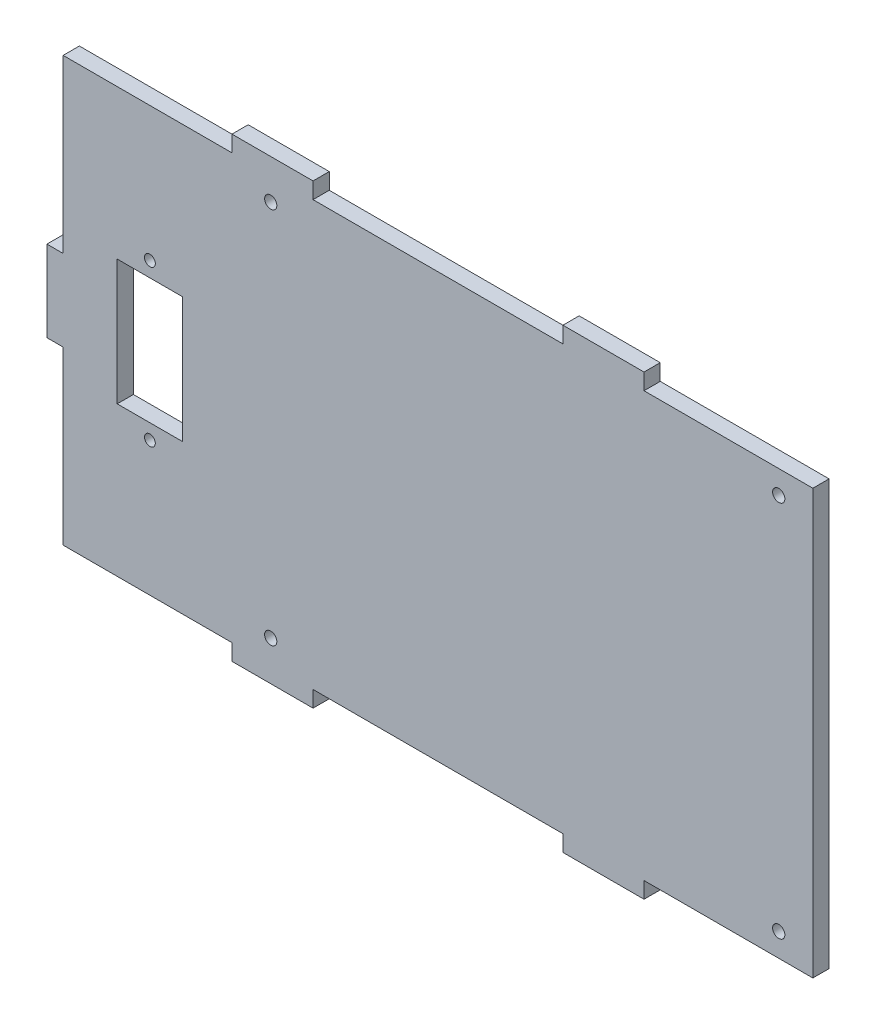
ISO-10303-21;
HEADER;
FILE_DESCRIPTION(('STEP AP214'),'2;1');
FILE_NAME('part.step','',(''),(''),'','','');
FILE_SCHEMA(('AUTOMOTIVE_DESIGN { 1 0 10303 214 1 1 1 1 }'));
ENDSEC;
DATA;
#1=APPLICATION_CONTEXT('core data for automotive mechanical design processes');
#2=APPLICATION_PROTOCOL_DEFINITION('international standard','automotive_design',2000,#1);
#3=PRODUCT_CONTEXT('',#1,'mechanical');
#4=PRODUCT('Part','Part','',(#3));
#5=PRODUCT_RELATED_PRODUCT_CATEGORY('part','',(#4));
#6=PRODUCT_DEFINITION_FORMATION('','',#4);
#7=PRODUCT_DEFINITION_CONTEXT('part definition',#1,'design');
#8=PRODUCT_DEFINITION('design','',#6,#7);
#9=PRODUCT_DEFINITION_SHAPE('','',#8);
#10=(LENGTH_UNIT() NAMED_UNIT(*) SI_UNIT(.MILLI.,.METRE.));
#11=(NAMED_UNIT(*) PLANE_ANGLE_UNIT() SI_UNIT($,.RADIAN.));
#12=(NAMED_UNIT(*) SI_UNIT($,.STERADIAN.) SOLID_ANGLE_UNIT());
#13=UNCERTAINTY_MEASURE_WITH_UNIT(LENGTH_MEASURE(1.E-05),#10,'distance_accuracy_value','');
#14=(GEOMETRIC_REPRESENTATION_CONTEXT(3) GLOBAL_UNCERTAINTY_ASSIGNED_CONTEXT((#13)) GLOBAL_UNIT_ASSIGNED_CONTEXT((#10,
#11,#12)) REPRESENTATION_CONTEXT('',''));
#15=CARTESIAN_POINT('',(0.,0.,0.));
#16=DIRECTION('',(0.,0.,1.));
#17=DIRECTION('',(1.,0.,0.));
#18=AXIS2_PLACEMENT_3D('',#15,#16,#17);
#19=CARTESIAN_POINT('',(-36.5479186476367,39.7550378756003,3.));
#20=DIRECTION('',(1.,0.,0.));
#21=DIRECTION('',(0.,1.,0.));
#22=AXIS2_PLACEMENT_3D('',#19,#20,#21);
#23=PLANE('',#22);
#24=DIRECTION('',(0.,-1.,0.));
#25=VECTOR('',#24,1.);
#26=CARTESIAN_POINT('',(-36.5479186476367,39.7550378756003,0.));
#27=LINE('',#26,#25);
#28=CARTESIAN_POINT('',(-36.5479186476367,71.4900378756003,0.));
#29=VERTEX_POINT('',#28);
#30=CARTESIAN_POINT('',(-36.5479186476367,39.7550378756003,0.));
#31=VERTEX_POINT('',#30);
#32=EDGE_CURVE('E279',#29,#31,#27,.T.);
#33=ORIENTED_EDGE('',*,*,#32,.T.);
#34=DIRECTION('',(0.,0.,-1.));
#35=VECTOR('',#34,1.);
#36=CARTESIAN_POINT('',(-36.5479186476367,39.7550378756003,3.));
#37=LINE('',#36,#35);
#38=CARTESIAN_POINT('',(-36.5479186476367,39.7550378756003,3.));
#39=VERTEX_POINT('',#38);
#40=EDGE_CURVE('E11',#39,#31,#37,.T.);
#41=ORIENTED_EDGE('',*,*,#40,.F.);
#42=DIRECTION('',(0.,-1.,0.));
#43=VECTOR('',#42,1.);
#44=CARTESIAN_POINT('',(-36.5479186476367,39.7550378756003,3.));
#45=LINE('',#44,#43);
#46=CARTESIAN_POINT('',(-36.5479186476367,71.4900378756003,3.));
#47=VERTEX_POINT('',#46);
#48=EDGE_CURVE('E282',#47,#39,#45,.T.);
#49=ORIENTED_EDGE('',*,*,#48,.F.);
#50=DIRECTION('',(0.,0.,-1.));
#51=VECTOR('',#50,1.);
#52=CARTESIAN_POINT('',(-36.5479186476367,71.4900378756003,3.));
#53=LINE('',#52,#51);
#54=EDGE_CURVE('E332',#47,#29,#53,.T.);
#55=ORIENTED_EDGE('',*,*,#54,.T.);
#56=EDGE_LOOP('',(#33,#41,#49,#55));
#57=FACE_BOUND('',#56,.T.);
#58=ADVANCED_FACE('F33',(#57),#23,.F.);
#59=CARTESIAN_POINT('',(-39.5479186476367,39.7550378756003,3.));
#60=DIRECTION('',(0.,-1.,0.));
#61=DIRECTION('',(0.,0.,-1.));
#62=AXIS2_PLACEMENT_3D('',#59,#60,#61);
#63=PLANE('',#62);
#64=DIRECTION('',(-1.,0.,0.));
#65=VECTOR('',#64,1.);
#66=CARTESIAN_POINT('',(-39.5479186476367,39.7550378756003,0.));
#67=LINE('',#66,#65);
#68=CARTESIAN_POINT('',(-39.5479186476367,39.7550378756003,0.));
#69=VERTEX_POINT('',#68);
#70=EDGE_CURVE('E335',#31,#69,#67,.T.);
#71=ORIENTED_EDGE('',*,*,#70,.T.);
#72=DIRECTION('',(0.,0.,-1.));
#73=VECTOR('',#72,1.);
#74=CARTESIAN_POINT('',(-39.5479186476367,39.7550378756003,3.));
#75=LINE('',#74,#73);
#76=CARTESIAN_POINT('',(-39.5479186476367,39.7550378756003,3.));
#77=VERTEX_POINT('',#76);
#78=EDGE_CURVE('E40',#77,#69,#75,.T.);
#79=ORIENTED_EDGE('',*,*,#78,.F.);
#80=DIRECTION('',(-1.,0.,0.));
#81=VECTOR('',#80,1.);
#82=CARTESIAN_POINT('',(-39.5479186476367,39.7550378756003,3.));
#83=LINE('',#82,#81);
#84=EDGE_CURVE('E285',#39,#77,#83,.T.);
#85=ORIENTED_EDGE('',*,*,#84,.F.);
#86=ORIENTED_EDGE('',*,*,#40,.T.);
#87=EDGE_LOOP('',(#71,#79,#85,#86));
#88=FACE_BOUND('',#87,.T.);
#89=ADVANCED_FACE('F471',(#88),#63,.F.);
#90=CARTESIAN_POINT('',(-39.5479186476367,24.7550378756003,3.));
#91=DIRECTION('',(1.,0.,0.));
#92=DIRECTION('',(0.,0.,-1.));
#93=AXIS2_PLACEMENT_3D('',#90,#91,#92);
#94=PLANE('',#93);
#95=DIRECTION('',(0.,-1.,0.));
#96=VECTOR('',#95,1.);
#97=CARTESIAN_POINT('',(-39.5479186476367,24.7550378756003,0.));
#98=LINE('',#97,#96);
#99=CARTESIAN_POINT('',(-39.5479186476367,24.7550378756003,0.));
#100=VERTEX_POINT('',#99);
#101=EDGE_CURVE('E337',#69,#100,#98,.T.);
#102=ORIENTED_EDGE('',*,*,#101,.T.);
#103=DIRECTION('',(0.,0.,-1.));
#104=VECTOR('',#103,1.);
#105=CARTESIAN_POINT('',(-39.5479186476367,24.7550378756003,3.));
#106=LINE('',#105,#104);
#107=CARTESIAN_POINT('',(-39.5479186476367,24.7550378756003,3.));
#108=VERTEX_POINT('',#107);
#109=EDGE_CURVE('E442',#108,#100,#106,.T.);
#110=ORIENTED_EDGE('',*,*,#109,.F.);
#111=DIRECTION('',(0.,-1.,0.));
#112=VECTOR('',#111,1.);
#113=CARTESIAN_POINT('',(-39.5479186476367,24.7550378756003,3.));
#114=LINE('',#113,#112);
#115=EDGE_CURVE('E288',#77,#108,#114,.T.);
#116=ORIENTED_EDGE('',*,*,#115,.F.);
#117=ORIENTED_EDGE('',*,*,#78,.T.);
#118=EDGE_LOOP('',(#102,#110,#116,#117));
#119=FACE_BOUND('',#118,.T.);
#120=ADVANCED_FACE('F449',(#119),#94,.F.);
#121=CARTESIAN_POINT('',(-36.5479186476367,24.7550378756003,3.));
#122=DIRECTION('',(0.,1.,0.));
#123=DIRECTION('',(-1.,0.,0.));
#124=AXIS2_PLACEMENT_3D('',#121,#122,#123);
#125=PLANE('',#124);
#126=DIRECTION('',(1.,0.,0.));
#127=VECTOR('',#126,1.);
#128=CARTESIAN_POINT('',(-36.5479186476367,24.7550378756003,0.));
#129=LINE('',#128,#127);
#130=CARTESIAN_POINT('',(-36.5479186476367,24.7550378756003,0.));
#131=VERTEX_POINT('',#130);
#132=EDGE_CURVE('E339',#100,#131,#129,.T.);
#133=ORIENTED_EDGE('',*,*,#132,.T.);
#134=DIRECTION('',(0.,0.,-1.));
#135=VECTOR('',#134,1.);
#136=CARTESIAN_POINT('',(-36.5479186476367,24.7550378756003,3.));
#137=LINE('',#136,#135);
#138=CARTESIAN_POINT('',(-36.5479186476367,24.7550378756003,3.));
#139=VERTEX_POINT('',#138);
#140=EDGE_CURVE('E439',#139,#131,#137,.T.);
#141=ORIENTED_EDGE('',*,*,#140,.F.);
#142=DIRECTION('',(1.,0.,0.));
#143=VECTOR('',#142,1.);
#144=CARTESIAN_POINT('',(-36.5479186476367,24.7550378756003,3.));
#145=LINE('',#144,#143);
#146=EDGE_CURVE('E290',#108,#139,#145,.T.);
#147=ORIENTED_EDGE('',*,*,#146,.F.);
#148=ORIENTED_EDGE('',*,*,#109,.T.);
#149=EDGE_LOOP('',(#133,#141,#147,#148));
#150=FACE_BOUND('',#149,.T.);
#151=ADVANCED_FACE('F459',(#150),#125,.F.);
#152=CARTESIAN_POINT('',(-36.5479186476367,-6.97996212439974,3.));
#153=DIRECTION('',(1.,0.,0.));
#154=DIRECTION('',(0.,1.,0.));
#155=AXIS2_PLACEMENT_3D('',#152,#153,#154);
#156=PLANE('',#155);
#157=DIRECTION('',(0.,-1.,0.));
#158=VECTOR('',#157,1.);
#159=CARTESIAN_POINT('',(-36.5479186476367,-6.97996212439974,0.));
#160=LINE('',#159,#158);
#161=CARTESIAN_POINT('',(-36.5479186476367,-6.97996212439974,0.));
#162=VERTEX_POINT('',#161);
#163=EDGE_CURVE('E341',#131,#162,#160,.T.);
#164=ORIENTED_EDGE('',*,*,#163,.T.);
#165=DIRECTION('',(0.,0.,-1.));
#166=VECTOR('',#165,1.);
#167=CARTESIAN_POINT('',(-36.5479186476367,-6.97996212439974,3.));
#168=LINE('',#167,#166);
#169=CARTESIAN_POINT('',(-36.5479186476367,-6.97996212439974,3.));
#170=VERTEX_POINT('',#169);
#171=EDGE_CURVE('E436',#170,#162,#168,.T.);
#172=ORIENTED_EDGE('',*,*,#171,.F.);
#173=DIRECTION('',(0.,-1.,0.));
#174=VECTOR('',#173,1.);
#175=CARTESIAN_POINT('',(-36.5479186476367,-6.97996212439974,3.));
#176=LINE('',#175,#174);
#177=EDGE_CURVE('E292',#139,#170,#176,.T.);
#178=ORIENTED_EDGE('',*,*,#177,.F.);
#179=ORIENTED_EDGE('',*,*,#140,.T.);
#180=EDGE_LOOP('',(#164,#172,#178,#179));
#181=FACE_BOUND('',#180,.T.);
#182=ADVANCED_FACE('F463',(#181),#156,.F.);
#183=CARTESIAN_POINT('',(-36.5479186476367,-6.97996212439974,3.));
#184=DIRECTION('',(0.,1.,0.));
#185=DIRECTION('',(-1.,0.,0.));
#186=AXIS2_PLACEMENT_3D('',#183,#184,#185);
#187=PLANE('',#186);
#188=DIRECTION('',(1.,0.,0.));
#189=VECTOR('',#188,1.);
#190=CARTESIAN_POINT('',(-36.5479186476367,-6.97996212439974,0.));
#191=LINE('',#190,#189);
#192=CARTESIAN_POINT('',(-5.31791864763672,-6.97996212439974,0.));
#193=VERTEX_POINT('',#192);
#194=EDGE_CURVE('E343',#162,#193,#191,.T.);
#195=ORIENTED_EDGE('',*,*,#194,.T.);
#196=DIRECTION('',(0.,0.,-1.));
#197=VECTOR('',#196,1.);
#198=CARTESIAN_POINT('',(-5.31791864763672,-6.97996212439974,3.));
#199=LINE('',#198,#197);
#200=CARTESIAN_POINT('',(-5.31791864763672,-6.97996212439974,3.));
#201=VERTEX_POINT('',#200);
#202=EDGE_CURVE('E433',#201,#193,#199,.T.);
#203=ORIENTED_EDGE('',*,*,#202,.F.);
#204=DIRECTION('',(1.,0.,0.));
#205=VECTOR('',#204,1.);
#206=CARTESIAN_POINT('',(-36.5479186476367,-6.97996212439974,3.));
#207=LINE('',#206,#205);
#208=EDGE_CURVE('E294',#170,#201,#207,.T.);
#209=ORIENTED_EDGE('',*,*,#208,.F.);
#210=ORIENTED_EDGE('',*,*,#171,.T.);
#211=EDGE_LOOP('',(#195,#203,#209,#210));
#212=FACE_BOUND('',#211,.T.);
#213=ADVANCED_FACE('F564',(#212),#187,.F.);
#214=CARTESIAN_POINT('',(-5.31791864763672,-6.97996212439974,3.));
#215=DIRECTION('',(1.,0.,0.));
#216=DIRECTION('',(0.,1.,0.));
#217=AXIS2_PLACEMENT_3D('',#214,#215,#216);
#218=PLANE('',#217);
#219=DIRECTION('',(0.,-1.,0.));
#220=VECTOR('',#219,1.);
#221=CARTESIAN_POINT('',(-5.31791864763672,-6.97996212439974,0.));
#222=LINE('',#221,#220);
#223=CARTESIAN_POINT('',(-5.31791864763672,-9.97996212439974,0.));
#224=VERTEX_POINT('',#223);
#225=EDGE_CURVE('E345',#193,#224,#222,.T.);
#226=ORIENTED_EDGE('',*,*,#225,.T.);
#227=DIRECTION('',(0.,0.,-1.));
#228=VECTOR('',#227,1.);
#229=CARTESIAN_POINT('',(-5.31791864763672,-9.97996212439974,3.));
#230=LINE('',#229,#228);
#231=CARTESIAN_POINT('',(-5.31791864763672,-9.97996212439974,3.));
#232=VERTEX_POINT('',#231);
#233=EDGE_CURVE('E430',#232,#224,#230,.T.);
#234=ORIENTED_EDGE('',*,*,#233,.F.);
#235=DIRECTION('',(0.,-1.,0.));
#236=VECTOR('',#235,1.);
#237=CARTESIAN_POINT('',(-5.31791864763672,-6.97996212439974,3.));
#238=LINE('',#237,#236);
#239=EDGE_CURVE('E296',#201,#232,#238,.T.);
#240=ORIENTED_EDGE('',*,*,#239,.F.);
#241=ORIENTED_EDGE('',*,*,#202,.T.);
#242=EDGE_LOOP('',(#226,#234,#240,#241));
#243=FACE_BOUND('',#242,.T.);
#244=ADVANCED_FACE('F562',(#243),#218,.F.);
#245=CARTESIAN_POINT('',(-5.31791864763672,-9.97996212439974,3.));
#246=DIRECTION('',(0.,1.,0.));
#247=DIRECTION('',(-1.,0.,0.));
#248=AXIS2_PLACEMENT_3D('',#245,#246,#247);
#249=PLANE('',#248);
#250=DIRECTION('',(1.,0.,0.));
#251=VECTOR('',#250,1.);
#252=CARTESIAN_POINT('',(-5.31791864763672,-9.97996212439974,0.));
#253=LINE('',#252,#251);
#254=CARTESIAN_POINT('',(9.68208135236328,-9.97996212439975,0.));
#255=VERTEX_POINT('',#254);
#256=EDGE_CURVE('E347',#224,#255,#253,.T.);
#257=ORIENTED_EDGE('',*,*,#256,.T.);
#258=DIRECTION('',(0.,0.,-1.));
#259=VECTOR('',#258,1.);
#260=CARTESIAN_POINT('',(9.68208135236328,-9.97996212439975,3.));
#261=LINE('',#260,#259);
#262=CARTESIAN_POINT('',(9.68208135236328,-9.97996212439975,3.));
#263=VERTEX_POINT('',#262);
#264=EDGE_CURVE('E427',#263,#255,#261,.T.);
#265=ORIENTED_EDGE('',*,*,#264,.F.);
#266=DIRECTION('',(1.,0.,0.));
#267=VECTOR('',#266,1.);
#268=CARTESIAN_POINT('',(-5.31791864763672,-9.97996212439974,3.));
#269=LINE('',#268,#267);
#270=EDGE_CURVE('E298',#232,#263,#269,.T.);
#271=ORIENTED_EDGE('',*,*,#270,.F.);
#272=ORIENTED_EDGE('',*,*,#233,.T.);
#273=EDGE_LOOP('',(#257,#265,#271,#272));
#274=FACE_BOUND('',#273,.T.);
#275=ADVANCED_FACE('F558',(#274),#249,.F.);
#276=CARTESIAN_POINT('',(9.68208135236328,-9.97996212439975,3.));
#277=DIRECTION('',(-1.,0.,0.));
#278=DIRECTION('',(0.,0.,1.));
#279=AXIS2_PLACEMENT_3D('',#276,#277,#278);
#280=PLANE('',#279);
#281=DIRECTION('',(0.,1.,0.));
#282=VECTOR('',#281,1.);
#283=CARTESIAN_POINT('',(9.68208135236328,-9.97996212439975,0.));
#284=LINE('',#283,#282);
#285=CARTESIAN_POINT('',(9.68208135236328,-6.97996212439973,0.));
#286=VERTEX_POINT('',#285);
#287=EDGE_CURVE('E349',#255,#286,#284,.T.);
#288=ORIENTED_EDGE('',*,*,#287,.T.);
#289=DIRECTION('',(0.,0.,-1.));
#290=VECTOR('',#289,1.);
#291=CARTESIAN_POINT('',(9.68208135236328,-6.97996212439973,3.));
#292=LINE('',#291,#290);
#293=CARTESIAN_POINT('',(9.68208135236328,-6.97996212439973,3.));
#294=VERTEX_POINT('',#293);
#295=EDGE_CURVE('E424',#294,#286,#292,.T.);
#296=ORIENTED_EDGE('',*,*,#295,.F.);
#297=DIRECTION('',(0.,1.,0.));
#298=VECTOR('',#297,1.);
#299=CARTESIAN_POINT('',(9.68208135236328,-9.97996212439975,3.));
#300=LINE('',#299,#298);
#301=EDGE_CURVE('E300',#263,#294,#300,.T.);
#302=ORIENTED_EDGE('',*,*,#301,.F.);
#303=ORIENTED_EDGE('',*,*,#264,.T.);
#304=EDGE_LOOP('',(#288,#296,#302,#303));
#305=FACE_BOUND('',#304,.T.);
#306=ADVANCED_FACE('F553',(#305),#280,.F.);
#307=CARTESIAN_POINT('',(9.68208135236328,-6.97996212439973,3.));
#308=DIRECTION('',(0.,1.,0.));
#309=DIRECTION('',(0.,0.,1.));
#310=AXIS2_PLACEMENT_3D('',#307,#308,#309);
#311=PLANE('',#310);
#312=DIRECTION('',(1.,0.,0.));
#313=VECTOR('',#312,1.);
#314=CARTESIAN_POINT('',(9.68208135236328,-6.97996212439973,0.));
#315=LINE('',#314,#313);
#316=CARTESIAN_POINT('',(55.9120813523633,-6.97996212439973,0.));
#317=VERTEX_POINT('',#316);
#318=EDGE_CURVE('E351',#286,#317,#315,.T.);
#319=ORIENTED_EDGE('',*,*,#318,.T.);
#320=DIRECTION('',(0.,0.,-1.));
#321=VECTOR('',#320,1.);
#322=CARTESIAN_POINT('',(55.9120813523633,-6.97996212439973,3.));
#323=LINE('',#322,#321);
#324=CARTESIAN_POINT('',(55.9120813523633,-6.97996212439973,3.));
#325=VERTEX_POINT('',#324);
#326=EDGE_CURVE('E421',#325,#317,#323,.T.);
#327=ORIENTED_EDGE('',*,*,#326,.F.);
#328=DIRECTION('',(1.,0.,0.));
#329=VECTOR('',#328,1.);
#330=CARTESIAN_POINT('',(9.68208135236328,-6.97996212439973,3.));
#331=LINE('',#330,#329);
#332=EDGE_CURVE('E302',#294,#325,#331,.T.);
#333=ORIENTED_EDGE('',*,*,#332,.F.);
#334=ORIENTED_EDGE('',*,*,#295,.T.);
#335=EDGE_LOOP('',(#319,#327,#333,#334));
#336=FACE_BOUND('',#335,.T.);
#337=ADVANCED_FACE('F547',(#336),#311,.F.);
#338=CARTESIAN_POINT('',(55.9120813523633,-6.97996212439973,3.));
#339=DIRECTION('',(1.,0.,0.));
#340=DIRECTION('',(0.,0.,-1.));
#341=AXIS2_PLACEMENT_3D('',#338,#339,#340);
#342=PLANE('',#341);
#343=DIRECTION('',(0.,-1.,0.));
#344=VECTOR('',#343,1.);
#345=CARTESIAN_POINT('',(55.9120813523633,-6.97996212439973,0.));
#346=LINE('',#345,#344);
#347=CARTESIAN_POINT('',(55.9120813523633,-9.97996212439973,0.));
#348=VERTEX_POINT('',#347);
#349=EDGE_CURVE('E353',#317,#348,#346,.T.);
#350=ORIENTED_EDGE('',*,*,#349,.T.);
#351=DIRECTION('',(0.,0.,-1.));
#352=VECTOR('',#351,1.);
#353=CARTESIAN_POINT('',(55.9120813523633,-9.97996212439973,3.));
#354=LINE('',#353,#352);
#355=CARTESIAN_POINT('',(55.9120813523633,-9.97996212439973,3.));
#356=VERTEX_POINT('',#355);
#357=EDGE_CURVE('E418',#356,#348,#354,.T.);
#358=ORIENTED_EDGE('',*,*,#357,.F.);
#359=DIRECTION('',(0.,-1.,0.));
#360=VECTOR('',#359,1.);
#361=CARTESIAN_POINT('',(55.9120813523633,-6.97996212439973,3.));
#362=LINE('',#361,#360);
#363=EDGE_CURVE('E304',#325,#356,#362,.T.);
#364=ORIENTED_EDGE('',*,*,#363,.F.);
#365=ORIENTED_EDGE('',*,*,#326,.T.);
#366=EDGE_LOOP('',(#350,#358,#364,#365));
#367=FACE_BOUND('',#366,.T.);
#368=ADVANCED_FACE('F543',(#367),#342,.F.);
#369=CARTESIAN_POINT('',(55.9120813523633,-9.97996212439973,3.));
#370=DIRECTION('',(0.,1.,0.));
#371=DIRECTION('',(-1.,0.,0.));
#372=AXIS2_PLACEMENT_3D('',#369,#370,#371);
#373=PLANE('',#372);
#374=DIRECTION('',(1.,0.,0.));
#375=VECTOR('',#374,1.);
#376=CARTESIAN_POINT('',(55.9120813523633,-9.97996212439973,0.));
#377=LINE('',#376,#375);
#378=CARTESIAN_POINT('',(70.9120813523633,-9.97996212439973,0.));
#379=VERTEX_POINT('',#378);
#380=EDGE_CURVE('E355',#348,#379,#377,.T.);
#381=ORIENTED_EDGE('',*,*,#380,.T.);
#382=DIRECTION('',(0.,0.,-1.));
#383=VECTOR('',#382,1.);
#384=CARTESIAN_POINT('',(70.9120813523633,-9.97996212439973,3.));
#385=LINE('',#384,#383);
#386=CARTESIAN_POINT('',(70.9120813523633,-9.97996212439973,3.));
#387=VERTEX_POINT('',#386);
#388=EDGE_CURVE('E415',#387,#379,#385,.T.);
#389=ORIENTED_EDGE('',*,*,#388,.F.);
#390=DIRECTION('',(1.,0.,0.));
#391=VECTOR('',#390,1.);
#392=CARTESIAN_POINT('',(55.9120813523633,-9.97996212439973,3.));
#393=LINE('',#392,#391);
#394=EDGE_CURVE('E306',#356,#387,#393,.T.);
#395=ORIENTED_EDGE('',*,*,#394,.F.);
#396=ORIENTED_EDGE('',*,*,#357,.T.);
#397=EDGE_LOOP('',(#381,#389,#395,#396));
#398=FACE_BOUND('',#397,.T.);
#399=ADVANCED_FACE('F538',(#398),#373,.F.);
#400=CARTESIAN_POINT('',(70.9120813523633,-9.97996212439973,3.));
#401=DIRECTION('',(-1.,0.,0.));
#402=DIRECTION('',(0.,0.,1.));
#403=AXIS2_PLACEMENT_3D('',#400,#401,#402);
#404=PLANE('',#403);
#405=DIRECTION('',(0.,1.,0.));
#406=VECTOR('',#405,1.);
#407=CARTESIAN_POINT('',(70.9120813523633,-9.97996212439973,0.));
#408=LINE('',#407,#406);
#409=CARTESIAN_POINT('',(70.9120813523633,-6.97996212439973,0.));
#410=VERTEX_POINT('',#409);
#411=EDGE_CURVE('E357',#379,#410,#408,.T.);
#412=ORIENTED_EDGE('',*,*,#411,.T.);
#413=DIRECTION('',(0.,0.,-1.));
#414=VECTOR('',#413,1.);
#415=CARTESIAN_POINT('',(70.9120813523633,-6.97996212439973,3.));
#416=LINE('',#415,#414);
#417=CARTESIAN_POINT('',(70.9120813523633,-6.97996212439973,3.));
#418=VERTEX_POINT('',#417);
#419=EDGE_CURVE('E412',#418,#410,#416,.T.);
#420=ORIENTED_EDGE('',*,*,#419,.F.);
#421=DIRECTION('',(0.,1.,0.));
#422=VECTOR('',#421,1.);
#423=CARTESIAN_POINT('',(70.9120813523633,-9.97996212439973,3.));
#424=LINE('',#423,#422);
#425=EDGE_CURVE('E308',#387,#418,#424,.T.);
#426=ORIENTED_EDGE('',*,*,#425,.F.);
#427=ORIENTED_EDGE('',*,*,#388,.T.);
#428=EDGE_LOOP('',(#412,#420,#426,#427));
#429=FACE_BOUND('',#428,.T.);
#430=ADVANCED_FACE('F532',(#429),#404,.F.);
#431=CARTESIAN_POINT('',(70.9120813523633,-6.97996212439973,3.));
#432=DIRECTION('',(0.,1.,0.));
#433=DIRECTION('',(0.,0.,1.));
#434=AXIS2_PLACEMENT_3D('',#431,#432,#433);
#435=PLANE('',#434);
#436=DIRECTION('',(1.,0.,0.));
#437=VECTOR('',#436,1.);
#438=CARTESIAN_POINT('',(70.9120813523633,-6.97996212439973,0.));
#439=LINE('',#438,#437);
#440=CARTESIAN_POINT('',(102.142081352363,-6.97996212439973,0.));
#441=VERTEX_POINT('',#440);
#442=EDGE_CURVE('E359',#410,#441,#439,.T.);
#443=ORIENTED_EDGE('',*,*,#442,.T.);
#444=DIRECTION('',(0.,0.,-1.));
#445=VECTOR('',#444,1.);
#446=CARTESIAN_POINT('',(102.142081352363,-6.97996212439973,3.));
#447=LINE('',#446,#445);
#448=CARTESIAN_POINT('',(102.142081352363,-6.97996212439973,3.));
#449=VERTEX_POINT('',#448);
#450=EDGE_CURVE('E409',#449,#441,#447,.T.);
#451=ORIENTED_EDGE('',*,*,#450,.F.);
#452=DIRECTION('',(1.,0.,0.));
#453=VECTOR('',#452,1.);
#454=CARTESIAN_POINT('',(70.9120813523633,-6.97996212439973,3.));
#455=LINE('',#454,#453);
#456=EDGE_CURVE('E310',#418,#449,#455,.T.);
#457=ORIENTED_EDGE('',*,*,#456,.F.);
#458=ORIENTED_EDGE('',*,*,#419,.T.);
#459=EDGE_LOOP('',(#443,#451,#457,#458));
#460=FACE_BOUND('',#459,.T.);
#461=ADVANCED_FACE('F528',(#460),#435,.F.);
#462=CARTESIAN_POINT('',(102.145081352363,71.4900378756003,3.));
#463=DIRECTION('',(-0.999999999269189,3.82311711201311E-05,0.));
#464=DIRECTION('',(-3.82311711201311E-05,-0.999999999269189,0.));
#465=AXIS2_PLACEMENT_3D('',#462,#463,#464);
#466=PLANE('',#465);
#467=DIRECTION('',(3.82311711201311E-05,0.999999999269189,0.));
#468=VECTOR('',#467,1.);
#469=CARTESIAN_POINT('',(102.145081352363,71.4900378756003,0.));
#470=LINE('',#469,#468);
#471=CARTESIAN_POINT('',(102.145081352363,71.4900378756003,0.));
#472=VERTEX_POINT('',#471);
#473=EDGE_CURVE('E361',#441,#472,#470,.T.);
#474=ORIENTED_EDGE('',*,*,#473,.T.);
#475=DIRECTION('',(0.,0.,-1.));
#476=VECTOR('',#475,1.);
#477=CARTESIAN_POINT('',(102.145081352363,71.4900378756003,3.));
#478=LINE('',#477,#476);
#479=CARTESIAN_POINT('',(102.145081352363,71.4900378756003,3.));
#480=VERTEX_POINT('',#479);
#481=EDGE_CURVE('E406',#480,#472,#478,.T.);
#482=ORIENTED_EDGE('',*,*,#481,.F.);
#483=DIRECTION('',(3.82311711201311E-05,0.999999999269189,0.));
#484=VECTOR('',#483,1.);
#485=CARTESIAN_POINT('',(102.145081352363,71.4900378756003,3.));
#486=LINE('',#485,#484);
#487=EDGE_CURVE('E312',#449,#480,#486,.T.);
#488=ORIENTED_EDGE('',*,*,#487,.F.);
#489=ORIENTED_EDGE('',*,*,#450,.T.);
#490=EDGE_LOOP('',(#474,#482,#488,#489));
#491=FACE_BOUND('',#490,.T.);
#492=ADVANCED_FACE('F523',(#491),#466,.F.);
#493=CARTESIAN_POINT('',(70.9120813523633,71.4900378756003,3.));
#494=DIRECTION('',(0.,-1.,0.));
#495=DIRECTION('',(1.,0.,0.));
#496=AXIS2_PLACEMENT_3D('',#493,#494,#495);
#497=PLANE('',#496);
#498=DIRECTION('',(-1.,0.,0.));
#499=VECTOR('',#498,1.);
#500=CARTESIAN_POINT('',(70.9120813523633,71.4900378756003,0.));
#501=LINE('',#500,#499);
#502=CARTESIAN_POINT('',(70.9120813523633,71.4900378756003,0.));
#503=VERTEX_POINT('',#502);
#504=EDGE_CURVE('E363',#472,#503,#501,.T.);
#505=ORIENTED_EDGE('',*,*,#504,.T.);
#506=DIRECTION('',(0.,0.,-1.));
#507=VECTOR('',#506,1.);
#508=CARTESIAN_POINT('',(70.9120813523633,71.4900378756003,3.));
#509=LINE('',#508,#507);
#510=CARTESIAN_POINT('',(70.9120813523633,71.4900378756003,3.));
#511=VERTEX_POINT('',#510);
#512=EDGE_CURVE('E403',#511,#503,#509,.T.);
#513=ORIENTED_EDGE('',*,*,#512,.F.);
#514=DIRECTION('',(-1.,0.,0.));
#515=VECTOR('',#514,1.);
#516=CARTESIAN_POINT('',(70.9120813523633,71.4900378756003,3.));
#517=LINE('',#516,#515);
#518=EDGE_CURVE('E314',#480,#511,#517,.T.);
#519=ORIENTED_EDGE('',*,*,#518,.F.);
#520=ORIENTED_EDGE('',*,*,#481,.T.);
#521=EDGE_LOOP('',(#505,#513,#519,#520));
#522=FACE_BOUND('',#521,.T.);
#523=ADVANCED_FACE('F517',(#522),#497,.F.);
#524=CARTESIAN_POINT('',(70.9120813523633,74.4900378756003,3.));
#525=DIRECTION('',(-1.,0.,0.));
#526=DIRECTION('',(0.,0.,1.));
#527=AXIS2_PLACEMENT_3D('',#524,#525,#526);
#528=PLANE('',#527);
#529=DIRECTION('',(0.,1.,0.));
#530=VECTOR('',#529,1.);
#531=CARTESIAN_POINT('',(70.9120813523633,74.4900378756003,0.));
#532=LINE('',#531,#530);
#533=CARTESIAN_POINT('',(70.9120813523633,74.4900378756003,0.));
#534=VERTEX_POINT('',#533);
#535=EDGE_CURVE('E365',#503,#534,#532,.T.);
#536=ORIENTED_EDGE('',*,*,#535,.T.);
#537=DIRECTION('',(0.,0.,-1.));
#538=VECTOR('',#537,1.);
#539=CARTESIAN_POINT('',(70.9120813523633,74.4900378756003,3.));
#540=LINE('',#539,#538);
#541=CARTESIAN_POINT('',(70.9120813523633,74.4900378756003,3.));
#542=VERTEX_POINT('',#541);
#543=EDGE_CURVE('E400',#542,#534,#540,.T.);
#544=ORIENTED_EDGE('',*,*,#543,.F.);
#545=DIRECTION('',(0.,1.,0.));
#546=VECTOR('',#545,1.);
#547=CARTESIAN_POINT('',(70.9120813523633,74.4900378756003,3.));
#548=LINE('',#547,#546);
#549=EDGE_CURVE('E316',#511,#542,#548,.T.);
#550=ORIENTED_EDGE('',*,*,#549,.F.);
#551=ORIENTED_EDGE('',*,*,#512,.T.);
#552=EDGE_LOOP('',(#536,#544,#550,#551));
#553=FACE_BOUND('',#552,.T.);
#554=ADVANCED_FACE('F513',(#553),#528,.F.);
#555=CARTESIAN_POINT('',(55.9120813523633,74.4900378756003,3.));
#556=DIRECTION('',(0.,-1.,0.));
#557=DIRECTION('',(1.,0.,0.));
#558=AXIS2_PLACEMENT_3D('',#555,#556,#557);
#559=PLANE('',#558);
#560=DIRECTION('',(-1.,0.,0.));
#561=VECTOR('',#560,1.);
#562=CARTESIAN_POINT('',(55.9120813523633,74.4900378756003,0.));
#563=LINE('',#562,#561);
#564=CARTESIAN_POINT('',(55.9120813523633,74.4900378756003,0.));
#565=VERTEX_POINT('',#564);
#566=EDGE_CURVE('E367',#534,#565,#563,.T.);
#567=ORIENTED_EDGE('',*,*,#566,.T.);
#568=DIRECTION('',(0.,0.,-1.));
#569=VECTOR('',#568,1.);
#570=CARTESIAN_POINT('',(55.9120813523633,74.4900378756003,3.));
#571=LINE('',#570,#569);
#572=CARTESIAN_POINT('',(55.9120813523633,74.4900378756003,3.));
#573=VERTEX_POINT('',#572);
#574=EDGE_CURVE('E397',#573,#565,#571,.T.);
#575=ORIENTED_EDGE('',*,*,#574,.F.);
#576=DIRECTION('',(-1.,0.,0.));
#577=VECTOR('',#576,1.);
#578=CARTESIAN_POINT('',(55.9120813523633,74.4900378756003,3.));
#579=LINE('',#578,#577);
#580=EDGE_CURVE('E318',#542,#573,#579,.T.);
#581=ORIENTED_EDGE('',*,*,#580,.F.);
#582=ORIENTED_EDGE('',*,*,#543,.T.);
#583=EDGE_LOOP('',(#567,#575,#581,#582));
#584=FACE_BOUND('',#583,.T.);
#585=ADVANCED_FACE('F508',(#584),#559,.F.);
#586=CARTESIAN_POINT('',(55.9120813523633,71.4900378756003,3.));
#587=DIRECTION('',(1.,0.,0.));
#588=DIRECTION('',(0.,0.,-1.));
#589=AXIS2_PLACEMENT_3D('',#586,#587,#588);
#590=PLANE('',#589);
#591=DIRECTION('',(0.,-1.,0.));
#592=VECTOR('',#591,1.);
#593=CARTESIAN_POINT('',(55.9120813523633,71.4900378756003,0.));
#594=LINE('',#593,#592);
#595=CARTESIAN_POINT('',(55.9120813523633,71.4900378756003,0.));
#596=VERTEX_POINT('',#595);
#597=EDGE_CURVE('E369',#565,#596,#594,.T.);
#598=ORIENTED_EDGE('',*,*,#597,.T.);
#599=DIRECTION('',(0.,0.,-1.));
#600=VECTOR('',#599,1.);
#601=CARTESIAN_POINT('',(55.9120813523633,71.4900378756003,3.));
#602=LINE('',#601,#600);
#603=CARTESIAN_POINT('',(55.9120813523633,71.4900378756003,3.));
#604=VERTEX_POINT('',#603);
#605=EDGE_CURVE('E394',#604,#596,#602,.T.);
#606=ORIENTED_EDGE('',*,*,#605,.F.);
#607=DIRECTION('',(0.,-1.,0.));
#608=VECTOR('',#607,1.);
#609=CARTESIAN_POINT('',(55.9120813523633,71.4900378756003,3.));
#610=LINE('',#609,#608);
#611=EDGE_CURVE('E320',#573,#604,#610,.T.);
#612=ORIENTED_EDGE('',*,*,#611,.F.);
#613=ORIENTED_EDGE('',*,*,#574,.T.);
#614=EDGE_LOOP('',(#598,#606,#612,#613));
#615=FACE_BOUND('',#614,.T.);
#616=ADVANCED_FACE('F502',(#615),#590,.F.);
#617=CARTESIAN_POINT('',(9.68208135236326,71.4900378756003,3.));
#618=DIRECTION('',(0.,-1.,0.));
#619=DIRECTION('',(0.,0.,-1.));
#620=AXIS2_PLACEMENT_3D('',#617,#618,#619);
#621=PLANE('',#620);
#622=DIRECTION('',(-1.,0.,0.));
#623=VECTOR('',#622,1.);
#624=CARTESIAN_POINT('',(9.68208135236326,71.4900378756003,0.));
#625=LINE('',#624,#623);
#626=CARTESIAN_POINT('',(9.68208135236326,71.4900378756003,0.));
#627=VERTEX_POINT('',#626);
#628=EDGE_CURVE('E371',#596,#627,#625,.T.);
#629=ORIENTED_EDGE('',*,*,#628,.T.);
#630=DIRECTION('',(0.,0.,-1.));
#631=VECTOR('',#630,1.);
#632=CARTESIAN_POINT('',(9.68208135236326,71.4900378756003,3.));
#633=LINE('',#632,#631);
#634=CARTESIAN_POINT('',(9.68208135236326,71.4900378756003,3.));
#635=VERTEX_POINT('',#634);
#636=EDGE_CURVE('E391',#635,#627,#633,.T.);
#637=ORIENTED_EDGE('',*,*,#636,.F.);
#638=DIRECTION('',(-1.,0.,0.));
#639=VECTOR('',#638,1.);
#640=CARTESIAN_POINT('',(9.68208135236326,71.4900378756003,3.));
#641=LINE('',#640,#639);
#642=EDGE_CURVE('E322',#604,#635,#641,.T.);
#643=ORIENTED_EDGE('',*,*,#642,.F.);
#644=ORIENTED_EDGE('',*,*,#605,.T.);
#645=EDGE_LOOP('',(#629,#637,#643,#644));
#646=FACE_BOUND('',#645,.T.);
#647=ADVANCED_FACE('F498',(#646),#621,.F.);
#648=CARTESIAN_POINT('',(9.68208135236326,74.4900378756003,3.));
#649=DIRECTION('',(-1.,0.,0.));
#650=DIRECTION('',(0.,0.,1.));
#651=AXIS2_PLACEMENT_3D('',#648,#649,#650);
#652=PLANE('',#651);
#653=DIRECTION('',(0.,1.,0.));
#654=VECTOR('',#653,1.);
#655=CARTESIAN_POINT('',(9.68208135236326,74.4900378756003,0.));
#656=LINE('',#655,#654);
#657=CARTESIAN_POINT('',(9.68208135236326,74.4900378756003,0.));
#658=VERTEX_POINT('',#657);
#659=EDGE_CURVE('E373',#627,#658,#656,.T.);
#660=ORIENTED_EDGE('',*,*,#659,.T.);
#661=DIRECTION('',(0.,0.,-1.));
#662=VECTOR('',#661,1.);
#663=CARTESIAN_POINT('',(9.68208135236326,74.4900378756003,3.));
#664=LINE('',#663,#662);
#665=CARTESIAN_POINT('',(9.68208135236326,74.4900378756003,3.));
#666=VERTEX_POINT('',#665);
#667=EDGE_CURVE('E388',#666,#658,#664,.T.);
#668=ORIENTED_EDGE('',*,*,#667,.F.);
#669=DIRECTION('',(0.,1.,0.));
#670=VECTOR('',#669,1.);
#671=CARTESIAN_POINT('',(9.68208135236326,74.4900378756003,3.));
#672=LINE('',#671,#670);
#673=EDGE_CURVE('E324',#635,#666,#672,.T.);
#674=ORIENTED_EDGE('',*,*,#673,.F.);
#675=ORIENTED_EDGE('',*,*,#636,.T.);
#676=EDGE_LOOP('',(#660,#668,#674,#675));
#677=FACE_BOUND('',#676,.T.);
#678=ADVANCED_FACE('F493',(#677),#652,.F.);
#679=CARTESIAN_POINT('',(-5.31791864763674,74.4900378756003,3.));
#680=DIRECTION('',(0.,-1.,0.));
#681=DIRECTION('',(0.,0.,-1.));
#682=AXIS2_PLACEMENT_3D('',#679,#680,#681);
#683=PLANE('',#682);
#684=DIRECTION('',(-1.,0.,0.));
#685=VECTOR('',#684,1.);
#686=CARTESIAN_POINT('',(-5.31791864763674,74.4900378756003,0.));
#687=LINE('',#686,#685);
#688=CARTESIAN_POINT('',(-5.31791864763674,74.4900378756003,0.));
#689=VERTEX_POINT('',#688);
#690=EDGE_CURVE('E375',#658,#689,#687,.T.);
#691=ORIENTED_EDGE('',*,*,#690,.T.);
#692=DIRECTION('',(0.,0.,-1.));
#693=VECTOR('',#692,1.);
#694=CARTESIAN_POINT('',(-5.31791864763674,74.4900378756003,3.));
#695=LINE('',#694,#693);
#696=CARTESIAN_POINT('',(-5.31791864763674,74.4900378756003,3.));
#697=VERTEX_POINT('',#696);
#698=EDGE_CURVE('E385',#697,#689,#695,.T.);
#699=ORIENTED_EDGE('',*,*,#698,.F.);
#700=DIRECTION('',(-1.,0.,0.));
#701=VECTOR('',#700,1.);
#702=CARTESIAN_POINT('',(-5.31791864763674,74.4900378756003,3.));
#703=LINE('',#702,#701);
#704=EDGE_CURVE('E326',#666,#697,#703,.T.);
#705=ORIENTED_EDGE('',*,*,#704,.F.);
#706=ORIENTED_EDGE('',*,*,#667,.T.);
#707=EDGE_LOOP('',(#691,#699,#705,#706));
#708=FACE_BOUND('',#707,.T.);
#709=ADVANCED_FACE('F487',(#708),#683,.F.);
#710=CARTESIAN_POINT('',(-5.31791864763674,71.4900378756003,3.));
#711=DIRECTION('',(1.,0.,0.));
#712=DIRECTION('',(0.,1.,0.));
#713=AXIS2_PLACEMENT_3D('',#710,#711,#712);
#714=PLANE('',#713);
#715=DIRECTION('',(0.,-1.,0.));
#716=VECTOR('',#715,1.);
#717=CARTESIAN_POINT('',(-5.31791864763674,71.4900378756003,0.));
#718=LINE('',#717,#716);
#719=CARTESIAN_POINT('',(-5.31791864763674,71.4900378756003,0.));
#720=VERTEX_POINT('',#719);
#721=EDGE_CURVE('E377',#689,#720,#718,.T.);
#722=ORIENTED_EDGE('',*,*,#721,.T.);
#723=DIRECTION('',(0.,0.,-1.));
#724=VECTOR('',#723,1.);
#725=CARTESIAN_POINT('',(-5.31791864763674,71.4900378756003,3.));
#726=LINE('',#725,#724);
#727=CARTESIAN_POINT('',(-5.31791864763674,71.4900378756003,3.));
#728=VERTEX_POINT('',#727);
#729=EDGE_CURVE('E382',#728,#720,#726,.T.);
#730=ORIENTED_EDGE('',*,*,#729,.F.);
#731=DIRECTION('',(0.,-1.,0.));
#732=VECTOR('',#731,1.);
#733=CARTESIAN_POINT('',(-5.31791864763674,71.4900378756003,3.));
#734=LINE('',#733,#732);
#735=EDGE_CURVE('E328',#697,#728,#734,.T.);
#736=ORIENTED_EDGE('',*,*,#735,.F.);
#737=ORIENTED_EDGE('',*,*,#698,.T.);
#738=EDGE_LOOP('',(#722,#730,#736,#737));
#739=FACE_BOUND('',#738,.T.);
#740=ADVANCED_FACE('F483',(#739),#714,.F.);
#741=CARTESIAN_POINT('',(-36.5479186476367,71.4900378756003,3.));
#742=DIRECTION('',(0.,-1.,0.));
#743=DIRECTION('',(0.,0.,-1.));
#744=AXIS2_PLACEMENT_3D('',#741,#742,#743);
#745=PLANE('',#744);
#746=DIRECTION('',(-1.,0.,0.));
#747=VECTOR('',#746,1.);
#748=CARTESIAN_POINT('',(-36.5479186476367,71.4900378756003,0.));
#749=LINE('',#748,#747);
#750=EDGE_CURVE('E286',#720,#29,#749,.T.);
#751=ORIENTED_EDGE('',*,*,#750,.T.);
#752=ORIENTED_EDGE('',*,*,#54,.F.);
#753=DIRECTION('',(-1.,0.,0.));
#754=VECTOR('',#753,1.);
#755=CARTESIAN_POINT('',(-36.5479186476367,71.4900378756003,3.));
#756=LINE('',#755,#754);
#757=EDGE_CURVE('E330',#728,#47,#756,.T.);
#758=ORIENTED_EDGE('',*,*,#757,.F.);
#759=ORIENTED_EDGE('',*,*,#729,.T.);
#760=EDGE_LOOP('',(#751,#752,#758,#759));
#761=FACE_BOUND('',#760,.T.);
#762=ADVANCED_FACE('F478',(#761),#745,.F.);
#763=CARTESIAN_POINT('',(0.,0.,3.));
#764=DIRECTION('',(0.,0.,-1.));
#765=DIRECTION('',(-1.,0.,0.));
#766=AXIS2_PLACEMENT_3D('',#763,#764,#765);
#767=PLANE('',#766);
#768=CARTESIAN_POINT('',(-20.4979186476367,17.8600378756003,3.));
#769=DIRECTION('',(0.,0.,1.));
#770=DIRECTION('',(1.,0.,0.));
#771=AXIS2_PLACEMENT_3D('',#768,#769,#770);
#772=CIRCLE('',#771,1.);
#773=CARTESIAN_POINT('',(-19.4979186476367,17.8600378756003,3.));
#774=VERTEX_POINT('',#773);
#775=EDGE_CURVE('E860',#774,#774,#772,.T.);
#776=ORIENTED_EDGE('',*,*,#775,.F.);
#777=EDGE_LOOP('',(#776));
#778=FACE_BOUND('',#777,.T.);
#779=CARTESIAN_POINT('',(-20.4979186476367,46.6600378756002,3.));
#780=DIRECTION('',(0.,0.,1.));
#781=DIRECTION('',(1.,0.,0.));
#782=AXIS2_PLACEMENT_3D('',#779,#780,#781);
#783=CIRCLE('',#782,1.);
#784=CARTESIAN_POINT('',(-19.4979186476367,46.6600378756002,3.));
#785=VERTEX_POINT('',#784);
#786=EDGE_CURVE('E241',#785,#785,#783,.T.);
#787=ORIENTED_EDGE('',*,*,#786,.F.);
#788=EDGE_LOOP('',(#787));
#789=FACE_BOUND('',#788,.T.);
#790=DIRECTION('',(1.,0.,0.));
#791=VECTOR('',#790,1.);
#792=CARTESIAN_POINT('',(-26.5479186476367,20.6600378756003,3.));
#793=LINE('',#792,#791);
#794=CARTESIAN_POINT('',(-26.5479186476367,20.6600378756003,3.));
#795=VERTEX_POINT('',#794);
#796=CARTESIAN_POINT('',(-14.4479186476367,20.6600378756003,3.));
#797=VERTEX_POINT('',#796);
#798=EDGE_CURVE('E247',#795,#797,#793,.T.);
#799=ORIENTED_EDGE('',*,*,#798,.F.);
#800=DIRECTION('',(0.,-1.,0.));
#801=VECTOR('',#800,1.);
#802=CARTESIAN_POINT('',(-26.5479186476367,43.8600378756002,3.));
#803=LINE('',#802,#801);
#804=CARTESIAN_POINT('',(-26.5479186476367,43.8600378756002,3.));
#805=VERTEX_POINT('',#804);
#806=EDGE_CURVE('E47',#805,#795,#803,.T.);
#807=ORIENTED_EDGE('',*,*,#806,.F.);
#808=DIRECTION('',(-1.,0.,0.));
#809=VECTOR('',#808,1.);
#810=CARTESIAN_POINT('',(-26.5479186476367,43.8600378756002,3.));
#811=LINE('',#810,#809);
#812=CARTESIAN_POINT('',(-14.4479186476367,43.8600378756002,3.));
#813=VERTEX_POINT('',#812);
#814=EDGE_CURVE('E235',#813,#805,#811,.T.);
#815=ORIENTED_EDGE('',*,*,#814,.F.);
#816=DIRECTION('',(0.,1.,0.));
#817=VECTOR('',#816,1.);
#818=CARTESIAN_POINT('',(-14.4479186476367,43.8600378756002,3.));
#819=LINE('',#818,#817);
#820=EDGE_CURVE('E238',#797,#813,#819,.T.);
#821=ORIENTED_EDGE('',*,*,#820,.F.);
#822=EDGE_LOOP('',(#799,#807,#815,#821));
#823=FACE_BOUND('',#822,.T.);
#824=CARTESIAN_POINT('',(1.85224605541785,-2.66996212439973,3.));
#825=DIRECTION('',(0.,0.,1.));
#826=DIRECTION('',(1.,0.,0.));
#827=AXIS2_PLACEMENT_3D('',#824,#825,#826);
#828=CIRCLE('',#827,1.13);
#829=CARTESIAN_POINT('',(2.98224605541785,-2.66996212439973,3.));
#830=VERTEX_POINT('',#829);
#831=EDGE_CURVE('E254',#830,#830,#828,.T.);
#832=ORIENTED_EDGE('',*,*,#831,.F.);
#833=EDGE_LOOP('',(#832));
#834=FACE_BOUND('',#833,.T.);
#835=CARTESIAN_POINT('',(1.85491650272255,67.1800378756003,3.));
#836=DIRECTION('',(0.,0.,1.));
#837=DIRECTION('',(1.,0.,0.));
#838=AXIS2_PLACEMENT_3D('',#835,#836,#837);
#839=CIRCLE('',#838,1.13);
#840=CARTESIAN_POINT('',(2.98491650272255,67.1800378756003,3.));
#841=VERTEX_POINT('',#840);
#842=EDGE_CURVE('E261',#841,#841,#839,.T.);
#843=ORIENTED_EDGE('',*,*,#842,.F.);
#844=EDGE_LOOP('',(#843));
#845=FACE_BOUND('',#844,.T.);
#846=CARTESIAN_POINT('',(95.8322461240995,-2.66996212439973,3.));
#847=DIRECTION('',(0.,0.,1.));
#848=DIRECTION('',(1.,0.,0.));
#849=AXIS2_PLACEMENT_3D('',#846,#847,#848);
#850=CIRCLE('',#849,1.13000000000001);
#851=CARTESIAN_POINT('',(96.9622461240995,-2.66996212439973,3.));
#852=VERTEX_POINT('',#851);
#853=EDGE_CURVE('E267',#852,#852,#850,.T.);
#854=ORIENTED_EDGE('',*,*,#853,.F.);
#855=EDGE_LOOP('',(#854));
#856=FACE_BOUND('',#855,.T.);
#857=CARTESIAN_POINT('',(95.8349165714042,67.1800378756003,3.));
#858=DIRECTION('',(0.,0.,1.));
#859=DIRECTION('',(1.,0.,0.));
#860=AXIS2_PLACEMENT_3D('',#857,#858,#859);
#861=CIRCLE('',#860,1.13000000000001);
#862=CARTESIAN_POINT('',(96.9649165714042,67.1800378756003,3.));
#863=VERTEX_POINT('',#862);
#864=EDGE_CURVE('E273',#863,#863,#861,.T.);
#865=ORIENTED_EDGE('',*,*,#864,.F.);
#866=EDGE_LOOP('',(#865));
#867=FACE_BOUND('',#866,.T.);
#868=ORIENTED_EDGE('',*,*,#48,.T.);
#869=ORIENTED_EDGE('',*,*,#84,.T.);
#870=ORIENTED_EDGE('',*,*,#115,.T.);
#871=ORIENTED_EDGE('',*,*,#146,.T.);
#872=ORIENTED_EDGE('',*,*,#177,.T.);
#873=ORIENTED_EDGE('',*,*,#208,.T.);
#874=ORIENTED_EDGE('',*,*,#239,.T.);
#875=ORIENTED_EDGE('',*,*,#270,.T.);
#876=ORIENTED_EDGE('',*,*,#301,.T.);
#877=ORIENTED_EDGE('',*,*,#332,.T.);
#878=ORIENTED_EDGE('',*,*,#363,.T.);
#879=ORIENTED_EDGE('',*,*,#394,.T.);
#880=ORIENTED_EDGE('',*,*,#425,.T.);
#881=ORIENTED_EDGE('',*,*,#456,.T.);
#882=ORIENTED_EDGE('',*,*,#487,.T.);
#883=ORIENTED_EDGE('',*,*,#518,.T.);
#884=ORIENTED_EDGE('',*,*,#549,.T.);
#885=ORIENTED_EDGE('',*,*,#580,.T.);
#886=ORIENTED_EDGE('',*,*,#611,.T.);
#887=ORIENTED_EDGE('',*,*,#642,.T.);
#888=ORIENTED_EDGE('',*,*,#673,.T.);
#889=ORIENTED_EDGE('',*,*,#704,.T.);
#890=ORIENTED_EDGE('',*,*,#735,.T.);
#891=ORIENTED_EDGE('',*,*,#757,.T.);
#892=EDGE_LOOP('',(#868,#869,#870,#871,#872,#873,#874,#875,#876,#877,#878,#879,#880,#881,#882,
#883,#884,#885,#886,#887,#888,#889,#890,#891));
#893=FACE_BOUND('',#892,.T.);
#894=ADVANCED_FACE('F467',(#778,#789,#823,#834,#845,#856,#867,#893),#767,.F.);
#895=CARTESIAN_POINT('',(0.,0.,0.));
#896=DIRECTION('',(0.,0.,-1.));
#897=DIRECTION('',(-1.,0.,0.));
#898=AXIS2_PLACEMENT_3D('',#895,#896,#897);
#899=PLANE('',#898);
#900=CARTESIAN_POINT('',(-20.4979186476367,17.8600378756003,0.));
#901=DIRECTION('',(0.,0.,1.));
#902=DIRECTION('',(1.,0.,0.));
#903=AXIS2_PLACEMENT_3D('',#900,#901,#902);
#904=CIRCLE('',#903,1.);
#905=CARTESIAN_POINT('',(-19.4979186476367,17.8600378756003,0.));
#906=VERTEX_POINT('',#905);
#907=EDGE_CURVE('E857',#906,#906,#904,.T.);
#908=ORIENTED_EDGE('',*,*,#907,.T.);
#909=EDGE_LOOP('',(#908));
#910=FACE_BOUND('',#909,.T.);
#911=CARTESIAN_POINT('',(-20.4979186476367,46.6600378756002,0.));
#912=DIRECTION('',(0.,0.,1.));
#913=DIRECTION('',(1.,0.,0.));
#914=AXIS2_PLACEMENT_3D('',#911,#912,#913);
#915=CIRCLE('',#914,1.);
#916=CARTESIAN_POINT('',(-19.4979186476367,46.6600378756002,0.));
#917=VERTEX_POINT('',#916);
#918=EDGE_CURVE('E248',#917,#917,#915,.T.);
#919=ORIENTED_EDGE('',*,*,#918,.T.);
#920=EDGE_LOOP('',(#919));
#921=FACE_BOUND('',#920,.T.);
#922=DIRECTION('',(0.,-1.,0.));
#923=VECTOR('',#922,1.);
#924=CARTESIAN_POINT('',(-26.5479186476367,43.8600378756002,0.));
#925=LINE('',#924,#923);
#926=CARTESIAN_POINT('',(-26.5479186476367,43.8600378756002,0.));
#927=VERTEX_POINT('',#926);
#928=CARTESIAN_POINT('',(-26.5479186476367,20.6600378756003,0.));
#929=VERTEX_POINT('',#928);
#930=EDGE_CURVE('E219',#927,#929,#925,.T.);
#931=ORIENTED_EDGE('',*,*,#930,.T.);
#932=DIRECTION('',(1.,0.,0.));
#933=VECTOR('',#932,1.);
#934=CARTESIAN_POINT('',(-26.5479186476367,20.6600378756003,0.));
#935=LINE('',#934,#933);
#936=CARTESIAN_POINT('',(-14.4479186476367,20.6600378756003,0.));
#937=VERTEX_POINT('',#936);
#938=EDGE_CURVE('E228',#929,#937,#935,.T.);
#939=ORIENTED_EDGE('',*,*,#938,.T.);
#940=DIRECTION('',(0.,1.,0.));
#941=VECTOR('',#940,1.);
#942=CARTESIAN_POINT('',(-14.4479186476367,43.8600378756002,0.));
#943=LINE('',#942,#941);
#944=CARTESIAN_POINT('',(-14.4479186476367,43.8600378756002,0.));
#945=VERTEX_POINT('',#944);
#946=EDGE_CURVE('E55',#937,#945,#943,.T.);
#947=ORIENTED_EDGE('',*,*,#946,.T.);
#948=DIRECTION('',(-1.,0.,0.));
#949=VECTOR('',#948,1.);
#950=CARTESIAN_POINT('',(-26.5479186476367,43.8600378756002,0.));
#951=LINE('',#950,#949);
#952=EDGE_CURVE('E225',#945,#927,#951,.T.);
#953=ORIENTED_EDGE('',*,*,#952,.T.);
#954=EDGE_LOOP('',(#931,#939,#947,#953));
#955=FACE_BOUND('',#954,.T.);
#956=CARTESIAN_POINT('',(1.85224605541785,-2.66996212439973,0.));
#957=DIRECTION('',(0.,0.,1.));
#958=DIRECTION('',(1.,0.,0.));
#959=AXIS2_PLACEMENT_3D('',#956,#957,#958);
#960=CIRCLE('',#959,1.13);
#961=CARTESIAN_POINT('',(2.98224605541785,-2.66996212439973,0.));
#962=VERTEX_POINT('',#961);
#963=EDGE_CURVE('E258',#962,#962,#960,.T.);
#964=ORIENTED_EDGE('',*,*,#963,.T.);
#965=EDGE_LOOP('',(#964));
#966=FACE_BOUND('',#965,.T.);
#967=CARTESIAN_POINT('',(1.85491650272255,67.1800378756003,0.));
#968=DIRECTION('',(0.,0.,1.));
#969=DIRECTION('',(1.,0.,0.));
#970=AXIS2_PLACEMENT_3D('',#967,#968,#969);
#971=CIRCLE('',#970,1.13);
#972=CARTESIAN_POINT('',(2.98491650272255,67.1800378756003,0.));
#973=VERTEX_POINT('',#972);
#974=EDGE_CURVE('E264',#973,#973,#971,.T.);
#975=ORIENTED_EDGE('',*,*,#974,.T.);
#976=EDGE_LOOP('',(#975));
#977=FACE_BOUND('',#976,.T.);
#978=CARTESIAN_POINT('',(95.8322461240995,-2.66996212439973,0.));
#979=DIRECTION('',(0.,0.,1.));
#980=DIRECTION('',(1.,0.,0.));
#981=AXIS2_PLACEMENT_3D('',#978,#979,#980);
#982=CIRCLE('',#981,1.13000000000001);
#983=CARTESIAN_POINT('',(96.9622461240995,-2.66996212439973,0.));
#984=VERTEX_POINT('',#983);
#985=EDGE_CURVE('E270',#984,#984,#982,.T.);
#986=ORIENTED_EDGE('',*,*,#985,.T.);
#987=EDGE_LOOP('',(#986));
#988=FACE_BOUND('',#987,.T.);
#989=CARTESIAN_POINT('',(95.8349165714042,67.1800378756003,0.));
#990=DIRECTION('',(0.,0.,1.));
#991=DIRECTION('',(1.,0.,0.));
#992=AXIS2_PLACEMENT_3D('',#989,#990,#991);
#993=CIRCLE('',#992,1.13000000000001);
#994=CARTESIAN_POINT('',(96.9649165714042,67.1800378756003,0.));
#995=VERTEX_POINT('',#994);
#996=EDGE_CURVE('E276',#995,#995,#993,.T.);
#997=ORIENTED_EDGE('',*,*,#996,.T.);
#998=EDGE_LOOP('',(#997));
#999=FACE_BOUND('',#998,.T.);
#1000=ORIENTED_EDGE('',*,*,#32,.F.);
#1001=ORIENTED_EDGE('',*,*,#750,.F.);
#1002=ORIENTED_EDGE('',*,*,#721,.F.);
#1003=ORIENTED_EDGE('',*,*,#690,.F.);
#1004=ORIENTED_EDGE('',*,*,#659,.F.);
#1005=ORIENTED_EDGE('',*,*,#628,.F.);
#1006=ORIENTED_EDGE('',*,*,#597,.F.);
#1007=ORIENTED_EDGE('',*,*,#566,.F.);
#1008=ORIENTED_EDGE('',*,*,#535,.F.);
#1009=ORIENTED_EDGE('',*,*,#504,.F.);
#1010=ORIENTED_EDGE('',*,*,#473,.F.);
#1011=ORIENTED_EDGE('',*,*,#442,.F.);
#1012=ORIENTED_EDGE('',*,*,#411,.F.);
#1013=ORIENTED_EDGE('',*,*,#380,.F.);
#1014=ORIENTED_EDGE('',*,*,#349,.F.);
#1015=ORIENTED_EDGE('',*,*,#318,.F.);
#1016=ORIENTED_EDGE('',*,*,#287,.F.);
#1017=ORIENTED_EDGE('',*,*,#256,.F.);
#1018=ORIENTED_EDGE('',*,*,#225,.F.);
#1019=ORIENTED_EDGE('',*,*,#194,.F.);
#1020=ORIENTED_EDGE('',*,*,#163,.F.);
#1021=ORIENTED_EDGE('',*,*,#132,.F.);
#1022=ORIENTED_EDGE('',*,*,#101,.F.);
#1023=ORIENTED_EDGE('',*,*,#70,.F.);
#1024=EDGE_LOOP('',(#1000,#1001,#1002,#1003,#1004,#1005,#1006,#1007,#1008,#1009,#1010,#1011,
#1012,#1013,#1014,#1015,#1016,#1017,#1018,#1019,#1020,#1021,#1022,#1023));
#1025=FACE_BOUND('',#1024,.T.);
#1026=ADVANCED_FACE('F232',(#910,#921,#955,#966,#977,#988,#999,#1025),#899,.T.);
#1027=CARTESIAN_POINT('',(95.8349165714042,67.1800378756003,0.));
#1028=DIRECTION('',(0.,0.,1.));
#1029=DIRECTION('',(1.,0.,0.));
#1030=AXIS2_PLACEMENT_3D('',#1027,#1028,#1029);
#1031=CYLINDRICAL_SURFACE('',#1030,1.13000000000001);
#1032=ORIENTED_EDGE('',*,*,#996,.F.);
#1033=EDGE_LOOP('',(#1032));
#1034=FACE_BOUND('',#1033,.T.);
#1035=ORIENTED_EDGE('',*,*,#864,.T.);
#1036=EDGE_LOOP('',(#1035));
#1037=FACE_BOUND('',#1036,.T.);
#1038=ADVANCED_FACE('F744',(#1034,#1037),#1031,.F.);
#1039=CARTESIAN_POINT('',(95.8322461240995,-2.66996212439973,0.));
#1040=DIRECTION('',(0.,0.,1.));
#1041=DIRECTION('',(1.,0.,0.));
#1042=AXIS2_PLACEMENT_3D('',#1039,#1040,#1041);
#1043=CYLINDRICAL_SURFACE('',#1042,1.13000000000001);
#1044=ORIENTED_EDGE('',*,*,#985,.F.);
#1045=EDGE_LOOP('',(#1044));
#1046=FACE_BOUND('',#1045,.T.);
#1047=ORIENTED_EDGE('',*,*,#853,.T.);
#1048=EDGE_LOOP('',(#1047));
#1049=FACE_BOUND('',#1048,.T.);
#1050=ADVANCED_FACE('F749',(#1046,#1049),#1043,.F.);
#1051=CARTESIAN_POINT('',(1.85491650272255,67.1800378756003,0.));
#1052=DIRECTION('',(0.,0.,1.));
#1053=DIRECTION('',(1.,0.,0.));
#1054=AXIS2_PLACEMENT_3D('',#1051,#1052,#1053);
#1055=CYLINDRICAL_SURFACE('',#1054,1.13);
#1056=ORIENTED_EDGE('',*,*,#974,.F.);
#1057=EDGE_LOOP('',(#1056));
#1058=FACE_BOUND('',#1057,.T.);
#1059=ORIENTED_EDGE('',*,*,#842,.T.);
#1060=EDGE_LOOP('',(#1059));
#1061=FACE_BOUND('',#1060,.T.);
#1062=ADVANCED_FACE('F761',(#1058,#1061),#1055,.F.);
#1063=CARTESIAN_POINT('',(1.85224605541785,-2.66996212439973,0.));
#1064=DIRECTION('',(0.,0.,1.));
#1065=DIRECTION('',(1.,0.,0.));
#1066=AXIS2_PLACEMENT_3D('',#1063,#1064,#1065);
#1067=CYLINDRICAL_SURFACE('',#1066,1.13);
#1068=ORIENTED_EDGE('',*,*,#963,.F.);
#1069=EDGE_LOOP('',(#1068));
#1070=FACE_BOUND('',#1069,.T.);
#1071=ORIENTED_EDGE('',*,*,#831,.T.);
#1072=EDGE_LOOP('',(#1071));
#1073=FACE_BOUND('',#1072,.T.);
#1074=ADVANCED_FACE('F771',(#1070,#1073),#1067,.F.);
#1075=CARTESIAN_POINT('',(-26.5479186476367,43.8600378756002,0.));
#1076=DIRECTION('',(-1.,0.,0.));
#1077=DIRECTION('',(0.,-1.,0.));
#1078=AXIS2_PLACEMENT_3D('',#1075,#1076,#1077);
#1079=PLANE('',#1078);
#1080=ORIENTED_EDGE('',*,*,#806,.T.);
#1081=DIRECTION('',(0.,0.,1.));
#1082=VECTOR('',#1081,1.);
#1083=CARTESIAN_POINT('',(-26.5479186476367,20.6600378756003,0.));
#1084=LINE('',#1083,#1082);
#1085=EDGE_CURVE('E215',#929,#795,#1084,.T.);
#1086=ORIENTED_EDGE('',*,*,#1085,.F.);
#1087=ORIENTED_EDGE('',*,*,#930,.F.);
#1088=DIRECTION('',(0.,0.,1.));
#1089=VECTOR('',#1088,1.);
#1090=CARTESIAN_POINT('',(-26.5479186476367,43.8600378756002,0.));
#1091=LINE('',#1090,#1089);
#1092=EDGE_CURVE('E252',#927,#805,#1091,.T.);
#1093=ORIENTED_EDGE('',*,*,#1092,.T.);
#1094=EDGE_LOOP('',(#1080,#1086,#1087,#1093));
#1095=FACE_BOUND('',#1094,.T.);
#1096=ADVANCED_FACE('F217',(#1095),#1079,.F.);
#1097=CARTESIAN_POINT('',(-26.5479186476367,43.8600378756002,0.));
#1098=DIRECTION('',(0.,1.,0.));
#1099=DIRECTION('',(0.,0.,1.));
#1100=AXIS2_PLACEMENT_3D('',#1097,#1098,#1099);
#1101=PLANE('',#1100);
#1102=ORIENTED_EDGE('',*,*,#814,.T.);
#1103=ORIENTED_EDGE('',*,*,#1092,.F.);
#1104=ORIENTED_EDGE('',*,*,#952,.F.);
#1105=DIRECTION('',(0.,0.,1.));
#1106=VECTOR('',#1105,1.);
#1107=CARTESIAN_POINT('',(-14.4479186476367,43.8600378756002,0.));
#1108=LINE('',#1107,#1106);
#1109=EDGE_CURVE('E255',#945,#813,#1108,.T.);
#1110=ORIENTED_EDGE('',*,*,#1109,.T.);
#1111=EDGE_LOOP('',(#1102,#1103,#1104,#1110));
#1112=FACE_BOUND('',#1111,.T.);
#1113=ADVANCED_FACE('F804',(#1112),#1101,.F.);
#1114=CARTESIAN_POINT('',(-14.4479186476367,43.8600378756002,0.));
#1115=DIRECTION('',(1.,0.,0.));
#1116=DIRECTION('',(0.,1.,0.));
#1117=AXIS2_PLACEMENT_3D('',#1114,#1115,#1116);
#1118=PLANE('',#1117);
#1119=ORIENTED_EDGE('',*,*,#820,.T.);
#1120=ORIENTED_EDGE('',*,*,#1109,.F.);
#1121=ORIENTED_EDGE('',*,*,#946,.F.);
#1122=DIRECTION('',(0.,0.,1.));
#1123=VECTOR('',#1122,1.);
#1124=CARTESIAN_POINT('',(-14.4479186476367,20.6600378756003,0.));
#1125=LINE('',#1124,#1123);
#1126=EDGE_CURVE('E224',#937,#797,#1125,.T.);
#1127=ORIENTED_EDGE('',*,*,#1126,.T.);
#1128=EDGE_LOOP('',(#1119,#1120,#1121,#1127));
#1129=FACE_BOUND('',#1128,.T.);
#1130=ADVANCED_FACE('F813',(#1129),#1118,.F.);
#1131=CARTESIAN_POINT('',(-26.5479186476367,20.6600378756003,0.));
#1132=DIRECTION('',(0.,-1.,0.));
#1133=DIRECTION('',(0.,0.,-1.));
#1134=AXIS2_PLACEMENT_3D('',#1131,#1132,#1133);
#1135=PLANE('',#1134);
#1136=ORIENTED_EDGE('',*,*,#798,.T.);
#1137=ORIENTED_EDGE('',*,*,#1126,.F.);
#1138=ORIENTED_EDGE('',*,*,#938,.F.);
#1139=ORIENTED_EDGE('',*,*,#1085,.T.);
#1140=EDGE_LOOP('',(#1136,#1137,#1138,#1139));
#1141=FACE_BOUND('',#1140,.T.);
#1142=ADVANCED_FACE('F229',(#1141),#1135,.F.);
#1143=CARTESIAN_POINT('',(-20.4979186476367,46.6600378756002,0.));
#1144=DIRECTION('',(0.,0.,1.));
#1145=DIRECTION('',(1.,0.,0.));
#1146=AXIS2_PLACEMENT_3D('',#1143,#1144,#1145);
#1147=CYLINDRICAL_SURFACE('',#1146,1.);
#1148=ORIENTED_EDGE('',*,*,#918,.F.);
#1149=EDGE_LOOP('',(#1148));
#1150=FACE_BOUND('',#1149,.T.);
#1151=ORIENTED_EDGE('',*,*,#786,.T.);
#1152=EDGE_LOOP('',(#1151));
#1153=FACE_BOUND('',#1152,.T.);
#1154=ADVANCED_FACE('F831',(#1150,#1153),#1147,.F.);
#1155=CARTESIAN_POINT('',(-20.4979186476367,17.8600378756003,0.));
#1156=DIRECTION('',(0.,0.,1.));
#1157=DIRECTION('',(1.,0.,0.));
#1158=AXIS2_PLACEMENT_3D('',#1155,#1156,#1157);
#1159=CYLINDRICAL_SURFACE('',#1158,1.);
#1160=ORIENTED_EDGE('',*,*,#907,.F.);
#1161=EDGE_LOOP('',(#1160));
#1162=FACE_BOUND('',#1161,.T.);
#1163=ORIENTED_EDGE('',*,*,#775,.T.);
#1164=EDGE_LOOP('',(#1163));
#1165=FACE_BOUND('',#1164,.T.);
#1166=ADVANCED_FACE('F840',(#1162,#1165),#1159,.F.);
#1167=CLOSED_SHELL('',(#58,#89,#120,#151,#182,#213,#244,#275,#306,#337,#368,#399,#430,#461,#492,
#523,#554,#585,#616,#647,#678,#709,#740,#762,#894,#1026,#1038,#1050,#1062,#1074,#1096,#1113,
#1130,#1142,#1154,#1166));
#1168=MANIFOLD_SOLID_BREP('B2',#1167);
#1169=ADVANCED_BREP_SHAPE_REPRESENTATION('',(#18,#1168),#14);
#1170=SHAPE_DEFINITION_REPRESENTATION(#9,#1169);
ENDSEC;
END-ISO-10303-21;
